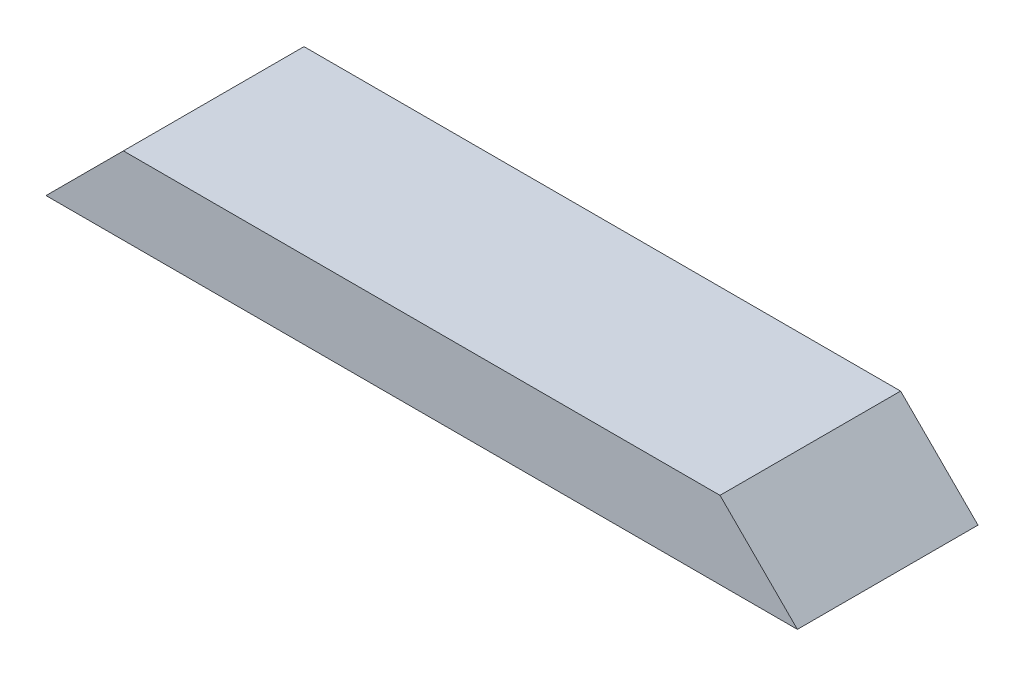
ISO-10303-21;
HEADER;
FILE_DESCRIPTION(('STEP AP214'),'2;1');
FILE_NAME('part.step','',(''),(''),'','','');
FILE_SCHEMA(('AUTOMOTIVE_DESIGN { 1 0 10303 214 1 1 1 1 }'));
ENDSEC;
DATA;
#1=APPLICATION_CONTEXT('core data for automotive mechanical design processes');
#2=APPLICATION_PROTOCOL_DEFINITION('international standard','automotive_design',2000,#1);
#3=PRODUCT_CONTEXT('',#1,'mechanical');
#4=PRODUCT('Part','Part','',(#3));
#5=PRODUCT_RELATED_PRODUCT_CATEGORY('part','',(#4));
#6=PRODUCT_DEFINITION_FORMATION('','',#4);
#7=PRODUCT_DEFINITION_CONTEXT('part definition',#1,'design');
#8=PRODUCT_DEFINITION('design','',#6,#7);
#9=PRODUCT_DEFINITION_SHAPE('','',#8);
#10=(LENGTH_UNIT() NAMED_UNIT(*) SI_UNIT(.MILLI.,.METRE.));
#11=(NAMED_UNIT(*) PLANE_ANGLE_UNIT() SI_UNIT($,.RADIAN.));
#12=(NAMED_UNIT(*) SI_UNIT($,.STERADIAN.) SOLID_ANGLE_UNIT());
#13=UNCERTAINTY_MEASURE_WITH_UNIT(LENGTH_MEASURE(1.E-05),#10,'distance_accuracy_value','');
#14=(GEOMETRIC_REPRESENTATION_CONTEXT(3) GLOBAL_UNCERTAINTY_ASSIGNED_CONTEXT((#13)) GLOBAL_UNIT_ASSIGNED_CONTEXT((#10,
#11,#12)) REPRESENTATION_CONTEXT('',''));
#15=CARTESIAN_POINT('',(0.,0.,0.));
#16=DIRECTION('',(0.,0.,1.));
#17=DIRECTION('',(1.,0.,0.));
#18=AXIS2_PLACEMENT_3D('',#15,#16,#17);
#19=CARTESIAN_POINT('',(0.,38.1,0.));
#20=DIRECTION('',(0.,0.,-1.));
#21=DIRECTION('',(-1.,0.,0.));
#22=AXIS2_PLACEMENT_3D('',#19,#20,#21);
#23=PLANE('',#22);
#24=DIRECTION('',(1.,0.,0.));
#25=VECTOR('',#24,1.);
#26=CARTESIAN_POINT('',(0.,38.1,0.));
#27=LINE('',#26,#25);
#28=CARTESIAN_POINT('',(38.1,38.1,0.));
#29=VERTEX_POINT('',#28);
#30=CARTESIAN_POINT('',(331.7875,38.0999999999999,0.));
#31=VERTEX_POINT('',#30);
#32=EDGE_CURVE('E46',#29,#31,#27,.T.);
#33=ORIENTED_EDGE('',*,*,#32,.F.);
#34=DIRECTION('',(0.707106781186547,0.707106781186547,0.));
#35=VECTOR('',#34,1.);
#36=CARTESIAN_POINT('',(0.,0.,0.));
#37=LINE('',#36,#35);
#38=CARTESIAN_POINT('',(0.,0.,0.));
#39=VERTEX_POINT('',#38);
#40=EDGE_CURVE('E81',#39,#29,#37,.T.);
#41=ORIENTED_EDGE('',*,*,#40,.F.);
#42=DIRECTION('',(1.,0.,0.));
#43=VECTOR('',#42,1.);
#44=CARTESIAN_POINT('',(0.,0.,0.));
#45=LINE('',#44,#43);
#46=CARTESIAN_POINT('',(369.8875,0.,0.));
#47=VERTEX_POINT('',#46);
#48=EDGE_CURVE('E86',#39,#47,#45,.T.);
#49=ORIENTED_EDGE('',*,*,#48,.T.);
#50=DIRECTION('',(0.707106781186549,-0.707106781186546,0.));
#51=VECTOR('',#50,1.);
#52=CARTESIAN_POINT('',(331.7875,38.0999999999999,0.));
#53=LINE('',#52,#51);
#54=EDGE_CURVE('E62',#31,#47,#53,.T.);
#55=ORIENTED_EDGE('',*,*,#54,.F.);
#56=EDGE_LOOP('',(#33,#41,#49,#55));
#57=FACE_BOUND('',#56,.T.);
#58=ADVANCED_FACE('F38',(#57),#23,.F.);
#59=CARTESIAN_POINT('',(0.,38.1,-88.9));
#60=DIRECTION('',(0.,0.,1.));
#61=DIRECTION('',(1.,0.,0.));
#62=AXIS2_PLACEMENT_3D('',#59,#60,#61);
#63=PLANE('',#62);
#64=DIRECTION('',(-1.,0.,0.));
#65=VECTOR('',#64,1.);
#66=CARTESIAN_POINT('',(0.,0.,-88.9));
#67=LINE('',#66,#65);
#68=CARTESIAN_POINT('',(369.8875,0.,-88.9));
#69=VERTEX_POINT('',#68);
#70=CARTESIAN_POINT('',(0.,0.,-88.9));
#71=VERTEX_POINT('',#70);
#72=EDGE_CURVE('E41',#69,#71,#67,.T.);
#73=ORIENTED_EDGE('',*,*,#72,.T.);
#74=DIRECTION('',(0.707106781186547,0.707106781186547,0.));
#75=VECTOR('',#74,1.);
#76=CARTESIAN_POINT('',(0.,0.,-88.9));
#77=LINE('',#76,#75);
#78=CARTESIAN_POINT('',(38.1,38.1,-88.9));
#79=VERTEX_POINT('',#78);
#80=EDGE_CURVE('E54',#71,#79,#77,.T.);
#81=ORIENTED_EDGE('',*,*,#80,.T.);
#82=DIRECTION('',(-1.,0.,0.));
#83=VECTOR('',#82,1.);
#84=CARTESIAN_POINT('',(0.,38.1,-88.9));
#85=LINE('',#84,#83);
#86=CARTESIAN_POINT('',(331.7875,38.0999999999999,-88.9));
#87=VERTEX_POINT('',#86);
#88=EDGE_CURVE('E11',#87,#79,#85,.T.);
#89=ORIENTED_EDGE('',*,*,#88,.F.);
#90=DIRECTION('',(0.707106781186549,-0.707106781186546,0.));
#91=VECTOR('',#90,1.);
#92=CARTESIAN_POINT('',(331.7875,38.0999999999999,-88.9));
#93=LINE('',#92,#91);
#94=EDGE_CURVE('E99',#87,#69,#93,.T.);
#95=ORIENTED_EDGE('',*,*,#94,.T.);
#96=EDGE_LOOP('',(#73,#81,#89,#95));
#97=FACE_BOUND('',#96,.T.);
#98=ADVANCED_FACE('F108',(#97),#63,.F.);
#99=CARTESIAN_POINT('',(0.,38.1,0.));
#100=DIRECTION('',(0.,-1.,0.));
#101=DIRECTION('',(0.,0.,-1.));
#102=AXIS2_PLACEMENT_3D('',#99,#100,#101);
#103=PLANE('',#102);
#104=ORIENTED_EDGE('',*,*,#88,.T.);
#105=DIRECTION('',(0.,0.,1.));
#106=VECTOR('',#105,1.);
#107=CARTESIAN_POINT('',(38.1,38.1,-88.9));
#108=LINE('',#107,#106);
#109=EDGE_CURVE('E87',#79,#29,#108,.T.);
#110=ORIENTED_EDGE('',*,*,#109,.T.);
#111=ORIENTED_EDGE('',*,*,#32,.T.);
#112=DIRECTION('',(0.,0.,1.));
#113=VECTOR('',#112,1.);
#114=CARTESIAN_POINT('',(331.7875,38.0999999999999,-88.9));
#115=LINE('',#114,#113);
#116=EDGE_CURVE('E102',#87,#31,#115,.T.);
#117=ORIENTED_EDGE('',*,*,#116,.F.);
#118=EDGE_LOOP('',(#104,#110,#111,#117));
#119=FACE_BOUND('',#118,.T.);
#120=ADVANCED_FACE('F111',(#119),#103,.F.);
#121=CARTESIAN_POINT('',(0.,0.,0.));
#122=DIRECTION('',(0.,-1.,0.));
#123=DIRECTION('',(0.,0.,-1.));
#124=AXIS2_PLACEMENT_3D('',#121,#122,#123);
#125=PLANE('',#124);
#126=DIRECTION('',(0.,0.,1.));
#127=VECTOR('',#126,1.);
#128=CARTESIAN_POINT('',(0.,0.,0.));
#129=LINE('',#128,#127);
#130=EDGE_CURVE('E78',#71,#39,#129,.T.);
#131=ORIENTED_EDGE('',*,*,#130,.F.);
#132=ORIENTED_EDGE('',*,*,#72,.F.);
#133=DIRECTION('',(0.,0.,-1.));
#134=VECTOR('',#133,1.);
#135=CARTESIAN_POINT('',(369.8875,0.,0.));
#136=LINE('',#135,#134);
#137=EDGE_CURVE('E95',#47,#69,#136,.T.);
#138=ORIENTED_EDGE('',*,*,#137,.F.);
#139=ORIENTED_EDGE('',*,*,#48,.F.);
#140=EDGE_LOOP('',(#131,#132,#138,#139));
#141=FACE_BOUND('',#140,.T.);
#142=ADVANCED_FACE('F94',(#141),#125,.T.);
#143=CARTESIAN_POINT('',(331.7875,38.0999999999999,-88.9));
#144=DIRECTION('',(-0.707106781186546,-0.707106781186549,0.));
#145=DIRECTION('',(0.707106781186549,-0.707106781186546,0.));
#146=AXIS2_PLACEMENT_3D('',#143,#144,#145);
#147=PLANE('',#146);
#148=ORIENTED_EDGE('',*,*,#54,.T.);
#149=ORIENTED_EDGE('',*,*,#137,.T.);
#150=ORIENTED_EDGE('',*,*,#94,.F.);
#151=ORIENTED_EDGE('',*,*,#116,.T.);
#152=EDGE_LOOP('',(#148,#149,#150,#151));
#153=FACE_BOUND('',#152,.T.);
#154=ADVANCED_FACE('F112',(#153),#147,.F.);
#155=CARTESIAN_POINT('',(0.,0.,-88.9));
#156=DIRECTION('',(0.707106781186547,-0.707106781186547,0.));
#157=DIRECTION('',(0.707106781186548,0.707106781186548,0.));
#158=AXIS2_PLACEMENT_3D('',#155,#156,#157);
#159=PLANE('',#158);
#160=ORIENTED_EDGE('',*,*,#40,.T.);
#161=ORIENTED_EDGE('',*,*,#109,.F.);
#162=ORIENTED_EDGE('',*,*,#80,.F.);
#163=ORIENTED_EDGE('',*,*,#130,.T.);
#164=EDGE_LOOP('',(#160,#161,#162,#163));
#165=FACE_BOUND('',#164,.T.);
#166=ADVANCED_FACE('F80',(#165),#159,.F.);
#167=CLOSED_SHELL('',(#58,#98,#120,#142,#154,#166));
#168=MANIFOLD_SOLID_BREP('B2',#167);
#169=ADVANCED_BREP_SHAPE_REPRESENTATION('',(#18,#168),#14);
#170=SHAPE_DEFINITION_REPRESENTATION(#9,#169);
ENDSEC;
END-ISO-10303-21;
